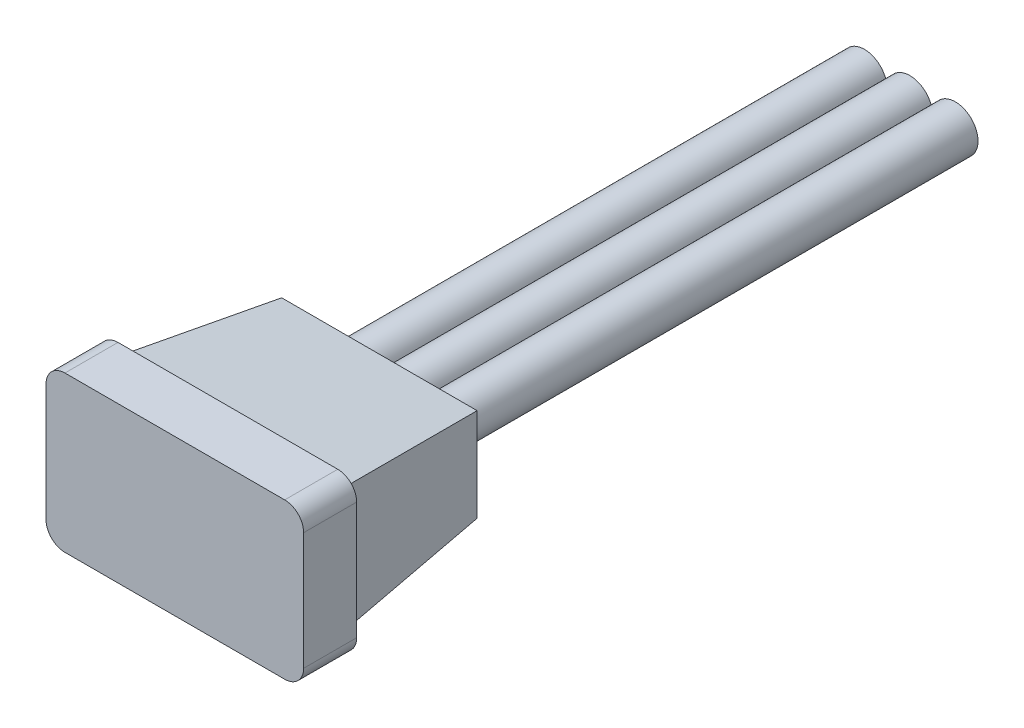
ISO-10303-21;
HEADER;
FILE_DESCRIPTION(('STEP AP214'),'2;1');
FILE_NAME('part.step','',(''),(''),'','','');
FILE_SCHEMA(('AUTOMOTIVE_DESIGN { 1 0 10303 214 1 1 1 1 }'));
ENDSEC;
DATA;
#1=APPLICATION_CONTEXT('core data for automotive mechanical design processes');
#2=APPLICATION_PROTOCOL_DEFINITION('international standard','automotive_design',2000,#1);
#3=PRODUCT_CONTEXT('',#1,'mechanical');
#4=PRODUCT('Part','Part','',(#3));
#5=PRODUCT_RELATED_PRODUCT_CATEGORY('part','',(#4));
#6=PRODUCT_DEFINITION_FORMATION('','',#4);
#7=PRODUCT_DEFINITION_CONTEXT('part definition',#1,'design');
#8=PRODUCT_DEFINITION('design','',#6,#7);
#9=PRODUCT_DEFINITION_SHAPE('','',#8);
#10=(LENGTH_UNIT() NAMED_UNIT(*) SI_UNIT(.MILLI.,.METRE.));
#11=(NAMED_UNIT(*) PLANE_ANGLE_UNIT() SI_UNIT($,.RADIAN.));
#12=(NAMED_UNIT(*) SI_UNIT($,.STERADIAN.) SOLID_ANGLE_UNIT());
#13=UNCERTAINTY_MEASURE_WITH_UNIT(LENGTH_MEASURE(1.E-05),#10,'distance_accuracy_value','');
#14=(GEOMETRIC_REPRESENTATION_CONTEXT(3) GLOBAL_UNCERTAINTY_ASSIGNED_CONTEXT((#13)) GLOBAL_UNIT_ASSIGNED_CONTEXT((#10,
#11,#12)) REPRESENTATION_CONTEXT('',''));
#15=CARTESIAN_POINT('',(0.,0.,0.));
#16=DIRECTION('',(0.,0.,1.));
#17=DIRECTION('',(1.,0.,0.));
#18=AXIS2_PLACEMENT_3D('',#15,#16,#17);
#19=CARTESIAN_POINT('',(1.2,0.,-21.0970562748477));
#20=DIRECTION('',(0.,0.,1.));
#21=DIRECTION('',(1.,0.,0.));
#22=AXIS2_PLACEMENT_3D('',#19,#20,#21);
#23=CYLINDRICAL_SURFACE('',#22,0.6);
#24=CARTESIAN_POINT('',(1.2,0.,-5.4));
#25=DIRECTION('',(0.,0.,-1.));
#26=DIRECTION('',(-1.,0.,0.));
#27=AXIS2_PLACEMENT_3D('',#24,#25,#26);
#28=CIRCLE('',#27,0.6);
#29=CARTESIAN_POINT('',(0.6,0.,-5.4));
#30=VERTEX_POINT('',#29);
#31=EDGE_CURVE('E54',#30,#30,#28,.T.);
#32=ORIENTED_EDGE('',*,*,#31,.T.);
#33=EDGE_LOOP('',(#32));
#34=FACE_BOUND('',#33,.T.);
#35=CARTESIAN_POINT('',(1.2,0.,-19.4));
#36=DIRECTION('',(0.,0.,-1.));
#37=DIRECTION('',(-1.,0.,0.));
#38=AXIS2_PLACEMENT_3D('',#35,#36,#37);
#39=CIRCLE('',#38,0.6);
#40=CARTESIAN_POINT('',(0.6,0.,-19.4));
#41=VERTEX_POINT('',#40);
#42=EDGE_CURVE('E11',#41,#41,#39,.T.);
#43=ORIENTED_EDGE('',*,*,#42,.F.);
#44=EDGE_LOOP('',(#43));
#45=FACE_BOUND('',#44,.T.);
#46=ADVANCED_FACE('F47',(#34,#45),#23,.T.);
#47=CARTESIAN_POINT('',(1.2,0.,-5.4));
#48=DIRECTION('',(0.,0.,-1.));
#49=DIRECTION('',(-1.,0.,0.));
#50=AXIS2_PLACEMENT_3D('',#47,#48,#49);
#51=PLANE('',#50);
#52=ORIENTED_EDGE('',*,*,#31,.F.);
#53=EDGE_LOOP('',(#52));
#54=FACE_BOUND('',#53,.T.);
#55=ADVANCED_FACE('F62',(#54),#51,.F.);
#56=CARTESIAN_POINT('',(0.,0.,-19.4));
#57=DIRECTION('',(0.,0.,-1.));
#58=DIRECTION('',(-1.,0.,0.));
#59=AXIS2_PLACEMENT_3D('',#56,#57,#58);
#60=PLANE('',#59);
#61=ORIENTED_EDGE('',*,*,#42,.T.);
#62=EDGE_LOOP('',(#61));
#63=FACE_BOUND('',#62,.T.);
#64=ADVANCED_FACE('F49',(#63),#60,.T.);
#65=CLOSED_SHELL('',(#46,#55,#64));
#66=MANIFOLD_SOLID_BREP('B2',#65);
#67=CARTESIAN_POINT('',(-1.2,0.,-21.0970562748477));
#68=DIRECTION('',(0.,0.,1.));
#69=DIRECTION('',(1.,0.,0.));
#70=AXIS2_PLACEMENT_3D('',#67,#68,#69);
#71=CYLINDRICAL_SURFACE('',#70,0.6);
#72=CARTESIAN_POINT('',(-1.2,0.,-5.4));
#73=DIRECTION('',(0.,0.,-1.));
#74=DIRECTION('',(-1.,0.,0.));
#75=AXIS2_PLACEMENT_3D('',#72,#73,#74);
#76=CIRCLE('',#75,0.6);
#77=CARTESIAN_POINT('',(-1.8,0.,-5.4));
#78=VERTEX_POINT('',#77);
#79=EDGE_CURVE('E107',#78,#78,#76,.T.);
#80=ORIENTED_EDGE('',*,*,#79,.T.);
#81=EDGE_LOOP('',(#80));
#82=FACE_BOUND('',#81,.T.);
#83=CARTESIAN_POINT('',(-1.2,0.,-19.4));
#84=DIRECTION('',(0.,0.,-1.));
#85=DIRECTION('',(-1.,0.,0.));
#86=AXIS2_PLACEMENT_3D('',#83,#84,#85);
#87=CIRCLE('',#86,0.6);
#88=CARTESIAN_POINT('',(-1.8,0.,-19.4));
#89=VERTEX_POINT('',#88);
#90=EDGE_CURVE('E46',#89,#89,#87,.T.);
#91=ORIENTED_EDGE('',*,*,#90,.F.);
#92=EDGE_LOOP('',(#91));
#93=FACE_BOUND('',#92,.T.);
#94=ADVANCED_FACE('F100',(#82,#93),#71,.T.);
#95=CARTESIAN_POINT('',(-1.2,0.,-5.4));
#96=DIRECTION('',(0.,0.,-1.));
#97=DIRECTION('',(-1.,0.,0.));
#98=AXIS2_PLACEMENT_3D('',#95,#96,#97);
#99=PLANE('',#98);
#100=ORIENTED_EDGE('',*,*,#79,.F.);
#101=EDGE_LOOP('',(#100));
#102=FACE_BOUND('',#101,.T.);
#103=ADVANCED_FACE('F116',(#102),#99,.F.);
#104=CARTESIAN_POINT('',(0.,0.,-19.4));
#105=DIRECTION('',(0.,0.,-1.));
#106=DIRECTION('',(-1.,0.,0.));
#107=AXIS2_PLACEMENT_3D('',#104,#105,#106);
#108=PLANE('',#107);
#109=ORIENTED_EDGE('',*,*,#90,.T.);
#110=EDGE_LOOP('',(#109));
#111=FACE_BOUND('',#110,.T.);
#112=ADVANCED_FACE('F102',(#111),#108,.T.);
#113=CLOSED_SHELL('',(#94,#103,#112));
#114=MANIFOLD_SOLID_BREP('B6',#113);
#115=CARTESIAN_POINT('',(0.,0.,-1.4));
#116=DIRECTION('',(0.,0.,1.));
#117=DIRECTION('',(1.,0.,0.));
#118=AXIS2_PLACEMENT_3D('',#115,#116,#117);
#119=PLANE('',#118);
#120=DIRECTION('',(1.,0.,0.));
#121=VECTOR('',#120,1.);
#122=CARTESIAN_POINT('',(-3.4,-2.05,-1.4));
#123=LINE('',#122,#121);
#124=CARTESIAN_POINT('',(-2.9,-2.05,-1.4));
#125=VERTEX_POINT('',#124);
#126=CARTESIAN_POINT('',(2.9,-2.05,-1.4));
#127=VERTEX_POINT('',#126);
#128=EDGE_CURVE('E291',#125,#127,#123,.T.);
#129=ORIENTED_EDGE('',*,*,#128,.F.);
#130=CARTESIAN_POINT('',(-2.9,-1.55,-1.4));
#131=DIRECTION('',(0.,0.,1.));
#132=DIRECTION('',(1.,0.,0.));
#133=AXIS2_PLACEMENT_3D('',#130,#131,#132);
#134=CIRCLE('',#133,0.5);
#135=CARTESIAN_POINT('',(-3.4,-1.55,-1.4));
#136=VERTEX_POINT('',#135);
#137=EDGE_CURVE('E331',#125,#136,#134,.F.);
#138=ORIENTED_EDGE('',*,*,#137,.T.);
#139=DIRECTION('',(0.,-1.,0.));
#140=VECTOR('',#139,1.);
#141=CARTESIAN_POINT('',(-3.4,2.05,-1.4));
#142=LINE('',#141,#140);
#143=CARTESIAN_POINT('',(-3.4,1.55,-1.4));
#144=VERTEX_POINT('',#143);
#145=EDGE_CURVE('E287',#144,#136,#142,.T.);
#146=ORIENTED_EDGE('',*,*,#145,.F.);
#147=CARTESIAN_POINT('',(-2.9,1.55,-1.4));
#148=DIRECTION('',(0.,0.,1.));
#149=DIRECTION('',(1.,0.,0.));
#150=AXIS2_PLACEMENT_3D('',#147,#148,#149);
#151=CIRCLE('',#150,0.5);
#152=CARTESIAN_POINT('',(-2.9,2.05,-1.4));
#153=VERTEX_POINT('',#152);
#154=EDGE_CURVE('E159',#144,#153,#151,.F.);
#155=ORIENTED_EDGE('',*,*,#154,.T.);
#156=DIRECTION('',(-1.,0.,0.));
#157=VECTOR('',#156,1.);
#158=CARTESIAN_POINT('',(-3.4,2.05,-1.4));
#159=LINE('',#158,#157);
#160=CARTESIAN_POINT('',(2.9,2.05,-1.4));
#161=VERTEX_POINT('',#160);
#162=EDGE_CURVE('E284',#161,#153,#159,.T.);
#163=ORIENTED_EDGE('',*,*,#162,.F.);
#164=CARTESIAN_POINT('',(2.9,1.55,-1.4));
#165=DIRECTION('',(0.,0.,1.));
#166=DIRECTION('',(1.,0.,0.));
#167=AXIS2_PLACEMENT_3D('',#164,#165,#166);
#168=CIRCLE('',#167,0.5);
#169=CARTESIAN_POINT('',(3.4,1.55,-1.4));
#170=VERTEX_POINT('',#169);
#171=EDGE_CURVE('E326',#161,#170,#168,.F.);
#172=ORIENTED_EDGE('',*,*,#171,.T.);
#173=DIRECTION('',(0.,1.,0.));
#174=VECTOR('',#173,1.);
#175=CARTESIAN_POINT('',(3.4,2.05,-1.4));
#176=LINE('',#175,#174);
#177=CARTESIAN_POINT('',(3.4,-1.55,-1.4));
#178=VERTEX_POINT('',#177);
#179=EDGE_CURVE('E281',#178,#170,#176,.T.);
#180=ORIENTED_EDGE('',*,*,#179,.F.);
#181=CARTESIAN_POINT('',(2.9,-1.55,-1.4));
#182=DIRECTION('',(0.,0.,1.));
#183=DIRECTION('',(1.,0.,0.));
#184=AXIS2_PLACEMENT_3D('',#181,#182,#183);
#185=CIRCLE('',#184,0.5);
#186=EDGE_CURVE('E328',#178,#127,#185,.F.);
#187=ORIENTED_EDGE('',*,*,#186,.T.);
#188=EDGE_LOOP('',(#129,#138,#146,#155,#163,#172,#180,#187));
#189=FACE_BOUND('',#188,.T.);
#190=DIRECTION('',(1.,0.,0.));
#191=VECTOR('',#190,1.);
#192=CARTESIAN_POINT('',(-3.,1.65,-1.4));
#193=LINE('',#192,#191);
#194=CARTESIAN_POINT('',(-3.,1.65,-1.4));
#195=VERTEX_POINT('',#194);
#196=CARTESIAN_POINT('',(3.,1.65,-1.4));
#197=VERTEX_POINT('',#196);
#198=EDGE_CURVE('E257',#195,#197,#193,.T.);
#199=ORIENTED_EDGE('',*,*,#198,.F.);
#200=DIRECTION('',(0.,1.,0.));
#201=VECTOR('',#200,1.);
#202=CARTESIAN_POINT('',(-3.,-1.65,-1.4));
#203=LINE('',#202,#201);
#204=CARTESIAN_POINT('',(-3.,-1.65,-1.4));
#205=VERTEX_POINT('',#204);
#206=EDGE_CURVE('E242',#205,#195,#203,.T.);
#207=ORIENTED_EDGE('',*,*,#206,.F.);
#208=DIRECTION('',(-1.,0.,0.));
#209=VECTOR('',#208,1.);
#210=CARTESIAN_POINT('',(3.,-1.65,-1.4));
#211=LINE('',#210,#209);
#212=CARTESIAN_POINT('',(3.,-1.65,-1.4));
#213=VERTEX_POINT('',#212);
#214=EDGE_CURVE('E237',#213,#205,#211,.T.);
#215=ORIENTED_EDGE('',*,*,#214,.F.);
#216=DIRECTION('',(0.,-1.,0.));
#217=VECTOR('',#216,1.);
#218=CARTESIAN_POINT('',(3.,1.65,-1.4));
#219=LINE('',#218,#217);
#220=EDGE_CURVE('E239',#197,#213,#219,.T.);
#221=ORIENTED_EDGE('',*,*,#220,.F.);
#222=EDGE_LOOP('',(#199,#207,#215,#221));
#223=FACE_BOUND('',#222,.T.);
#224=ADVANCED_FACE('F144',(#189,#223),#119,.F.);
#225=CARTESIAN_POINT('',(3.4,2.05,-1.4));
#226=DIRECTION('',(1.,0.,0.));
#227=DIRECTION('',(0.,1.,0.));
#228=AXIS2_PLACEMENT_3D('',#225,#226,#227);
#229=PLANE('',#228);
#230=DIRECTION('',(0.,1.,0.));
#231=VECTOR('',#230,1.);
#232=CARTESIAN_POINT('',(3.4,2.05,0.));
#233=LINE('',#232,#231);
#234=CARTESIAN_POINT('',(3.4,-1.55,0.));
#235=VERTEX_POINT('',#234);
#236=CARTESIAN_POINT('',(3.4,1.55,0.));
#237=VERTEX_POINT('',#236);
#238=EDGE_CURVE('E265',#235,#237,#233,.T.);
#239=ORIENTED_EDGE('',*,*,#238,.F.);
#240=DIRECTION('',(0.,0.,1.));
#241=VECTOR('',#240,1.);
#242=CARTESIAN_POINT('',(3.4,-1.55,-1.4));
#243=LINE('',#242,#241);
#244=EDGE_CURVE('E98',#235,#178,#243,.F.);
#245=ORIENTED_EDGE('',*,*,#244,.T.);
#246=ORIENTED_EDGE('',*,*,#179,.T.);
#247=DIRECTION('',(0.,0.,1.));
#248=VECTOR('',#247,1.);
#249=CARTESIAN_POINT('',(3.4,1.55,-1.4));
#250=LINE('',#249,#248);
#251=EDGE_CURVE('E152',#170,#237,#250,.T.);
#252=ORIENTED_EDGE('',*,*,#251,.T.);
#253=EDGE_LOOP('',(#239,#245,#246,#252));
#254=FACE_BOUND('',#253,.T.);
#255=ADVANCED_FACE('F341',(#254),#229,.T.);
#256=CARTESIAN_POINT('',(-3.4,-2.05,-1.4));
#257=DIRECTION('',(0.,-1.,0.));
#258=DIRECTION('',(0.,0.,-1.));
#259=AXIS2_PLACEMENT_3D('',#256,#257,#258);
#260=PLANE('',#259);
#261=DIRECTION('',(1.,0.,0.));
#262=VECTOR('',#261,1.);
#263=CARTESIAN_POINT('',(-3.4,-2.05,0.));
#264=LINE('',#263,#262);
#265=CARTESIAN_POINT('',(-2.9,-2.05,0.));
#266=VERTEX_POINT('',#265);
#267=CARTESIAN_POINT('',(2.9,-2.05,0.));
#268=VERTEX_POINT('',#267);
#269=EDGE_CURVE('E285',#266,#268,#264,.T.);
#270=ORIENTED_EDGE('',*,*,#269,.F.);
#271=DIRECTION('',(0.,0.,1.));
#272=VECTOR('',#271,1.);
#273=CARTESIAN_POINT('',(-2.9,-2.05,-1.4));
#274=LINE('',#273,#272);
#275=EDGE_CURVE('E324',#266,#125,#274,.F.);
#276=ORIENTED_EDGE('',*,*,#275,.T.);
#277=ORIENTED_EDGE('',*,*,#128,.T.);
#278=DIRECTION('',(0.,0.,1.));
#279=VECTOR('',#278,1.);
#280=CARTESIAN_POINT('',(2.9,-2.05,-1.4));
#281=LINE('',#280,#279);
#282=EDGE_CURVE('E321',#127,#268,#281,.T.);
#283=ORIENTED_EDGE('',*,*,#282,.T.);
#284=EDGE_LOOP('',(#270,#276,#277,#283));
#285=FACE_BOUND('',#284,.T.);
#286=ADVANCED_FACE('F354',(#285),#260,.T.);
#287=CARTESIAN_POINT('',(-3.4,2.05,-1.4));
#288=DIRECTION('',(-1.,0.,0.));
#289=DIRECTION('',(0.,-1.,0.));
#290=AXIS2_PLACEMENT_3D('',#287,#288,#289);
#291=PLANE('',#290);
#292=ORIENTED_EDGE('',*,*,#145,.T.);
#293=DIRECTION('',(0.,0.,1.));
#294=VECTOR('',#293,1.);
#295=CARTESIAN_POINT('',(-3.4,-1.55,-1.4));
#296=LINE('',#295,#294);
#297=CARTESIAN_POINT('',(-3.4,-1.55,0.));
#298=VERTEX_POINT('',#297);
#299=EDGE_CURVE('E309',#136,#298,#296,.T.);
#300=ORIENTED_EDGE('',*,*,#299,.T.);
#301=DIRECTION('',(0.,-1.,0.));
#302=VECTOR('',#301,1.);
#303=CARTESIAN_POINT('',(-3.4,2.05,0.));
#304=LINE('',#303,#302);
#305=CARTESIAN_POINT('',(-3.4,1.55,0.));
#306=VERTEX_POINT('',#305);
#307=EDGE_CURVE('E301',#306,#298,#304,.T.);
#308=ORIENTED_EDGE('',*,*,#307,.F.);
#309=DIRECTION('',(0.,0.,1.));
#310=VECTOR('',#309,1.);
#311=CARTESIAN_POINT('',(-3.4,1.55,-1.4));
#312=LINE('',#311,#310);
#313=EDGE_CURVE('E307',#306,#144,#312,.F.);
#314=ORIENTED_EDGE('',*,*,#313,.T.);
#315=EDGE_LOOP('',(#292,#300,#308,#314));
#316=FACE_BOUND('',#315,.T.);
#317=ADVANCED_FACE('F363',(#316),#291,.T.);
#318=CARTESIAN_POINT('',(-3.4,2.05,-1.4));
#319=DIRECTION('',(0.,1.,0.));
#320=DIRECTION('',(0.,0.,1.));
#321=AXIS2_PLACEMENT_3D('',#318,#319,#320);
#322=PLANE('',#321);
#323=ORIENTED_EDGE('',*,*,#162,.T.);
#324=DIRECTION('',(0.,0.,1.));
#325=VECTOR('',#324,1.);
#326=CARTESIAN_POINT('',(-2.9,2.05,-1.4));
#327=LINE('',#326,#325);
#328=CARTESIAN_POINT('',(-2.9,2.05,0.));
#329=VERTEX_POINT('',#328);
#330=EDGE_CURVE('E335',#153,#329,#327,.T.);
#331=ORIENTED_EDGE('',*,*,#330,.T.);
#332=DIRECTION('',(-1.,0.,0.));
#333=VECTOR('',#332,1.);
#334=CARTESIAN_POINT('',(-3.4,2.05,0.));
#335=LINE('',#334,#333);
#336=CARTESIAN_POINT('',(2.9,2.05,0.));
#337=VERTEX_POINT('',#336);
#338=EDGE_CURVE('E298',#337,#329,#335,.T.);
#339=ORIENTED_EDGE('',*,*,#338,.F.);
#340=DIRECTION('',(0.,0.,1.));
#341=VECTOR('',#340,1.);
#342=CARTESIAN_POINT('',(2.9,2.05,-1.4));
#343=LINE('',#342,#341);
#344=EDGE_CURVE('E166',#337,#161,#343,.F.);
#345=ORIENTED_EDGE('',*,*,#344,.T.);
#346=EDGE_LOOP('',(#323,#331,#339,#345));
#347=FACE_BOUND('',#346,.T.);
#348=ADVANCED_FACE('F368',(#347),#322,.T.);
#349=CARTESIAN_POINT('',(0.,0.,0.));
#350=DIRECTION('',(0.,0.,1.));
#351=DIRECTION('',(1.,0.,0.));
#352=AXIS2_PLACEMENT_3D('',#349,#350,#351);
#353=PLANE('',#352);
#354=ORIENTED_EDGE('',*,*,#307,.T.);
#355=CARTESIAN_POINT('',(-2.9,-1.55,0.));
#356=DIRECTION('',(0.,0.,1.));
#357=DIRECTION('',(1.,0.,0.));
#358=AXIS2_PLACEMENT_3D('',#355,#356,#357);
#359=CIRCLE('',#358,0.5);
#360=EDGE_CURVE('E319',#298,#266,#359,.T.);
#361=ORIENTED_EDGE('',*,*,#360,.T.);
#362=ORIENTED_EDGE('',*,*,#269,.T.);
#363=CARTESIAN_POINT('',(2.9,-1.55,0.));
#364=DIRECTION('',(0.,0.,1.));
#365=DIRECTION('',(1.,0.,0.));
#366=AXIS2_PLACEMENT_3D('',#363,#364,#365);
#367=CIRCLE('',#366,0.5);
#368=EDGE_CURVE('E315',#268,#235,#367,.T.);
#369=ORIENTED_EDGE('',*,*,#368,.T.);
#370=ORIENTED_EDGE('',*,*,#238,.T.);
#371=CARTESIAN_POINT('',(2.9,1.55,0.));
#372=DIRECTION('',(0.,0.,1.));
#373=DIRECTION('',(1.,0.,0.));
#374=AXIS2_PLACEMENT_3D('',#371,#372,#373);
#375=CIRCLE('',#374,0.5);
#376=EDGE_CURVE('E313',#237,#337,#375,.T.);
#377=ORIENTED_EDGE('',*,*,#376,.T.);
#378=ORIENTED_EDGE('',*,*,#338,.T.);
#379=CARTESIAN_POINT('',(-2.9,1.55,0.));
#380=DIRECTION('',(0.,0.,1.));
#381=DIRECTION('',(1.,0.,0.));
#382=AXIS2_PLACEMENT_3D('',#379,#380,#381);
#383=CIRCLE('',#382,0.5);
#384=EDGE_CURVE('E317',#329,#306,#383,.T.);
#385=ORIENTED_EDGE('',*,*,#384,.T.);
#386=EDGE_LOOP('',(#354,#361,#362,#369,#370,#377,#378,#385));
#387=FACE_BOUND('',#386,.T.);
#388=ADVANCED_FACE('F347',(#387),#353,.T.);
#389=CARTESIAN_POINT('',(-3.,1.65,-1.4));
#390=DIRECTION('',(0.,0.994521895368273,-0.104528463267654));
#391=DIRECTION('',(0.,0.104528463267654,0.994521895368273));
#392=AXIS2_PLACEMENT_3D('',#389,#390,#391);
#393=PLANE('',#392);
#394=ORIENTED_EDGE('',*,*,#198,.T.);
#395=DIRECTION('',(0.103962051184498,0.103962051184498,0.989132844377854));
#396=VECTOR('',#395,1.);
#397=CARTESIAN_POINT('',(3.,1.65,-1.4));
#398=LINE('',#397,#396);
#399=CARTESIAN_POINT('',(2.57958305893729,1.22958305893729,-5.4));
#400=VERTEX_POINT('',#399);
#401=EDGE_CURVE('E255',#400,#197,#398,.T.);
#402=ORIENTED_EDGE('',*,*,#401,.F.);
#403=DIRECTION('',(-1.,0.,0.));
#404=VECTOR('',#403,1.);
#405=CARTESIAN_POINT('',(-3.,1.22958305893729,-5.4));
#406=LINE('',#405,#404);
#407=CARTESIAN_POINT('',(-2.57958305893729,1.22958305893729,-5.4));
#408=VERTEX_POINT('',#407);
#409=EDGE_CURVE('E272',#408,#400,#406,.F.);
#410=ORIENTED_EDGE('',*,*,#409,.F.);
#411=DIRECTION('',(-0.103962051184498,0.103962051184498,0.989132844377854));
#412=VECTOR('',#411,1.);
#413=CARTESIAN_POINT('',(-3.,1.65,-1.4));
#414=LINE('',#413,#412);
#415=EDGE_CURVE('E268',#408,#195,#414,.T.);
#416=ORIENTED_EDGE('',*,*,#415,.T.);
#417=EDGE_LOOP('',(#394,#402,#410,#416));
#418=FACE_BOUND('',#417,.T.);
#419=ADVANCED_FACE('F384',(#418),#393,.T.);
#420=CARTESIAN_POINT('',(3.,1.65,-1.4));
#421=DIRECTION('',(0.994521895368273,0.,-0.104528463267654));
#422=DIRECTION('',(-0.104528463267654,0.,-0.994521895368273));
#423=AXIS2_PLACEMENT_3D('',#420,#421,#422);
#424=PLANE('',#423);
#425=ORIENTED_EDGE('',*,*,#220,.T.);
#426=DIRECTION('',(0.103962051184498,-0.103962051184498,0.989132844377854));
#427=VECTOR('',#426,1.);
#428=CARTESIAN_POINT('',(3.,-1.65,-1.4));
#429=LINE('',#428,#427);
#430=CARTESIAN_POINT('',(2.57958305893729,-1.22958305893729,-5.4));
#431=VERTEX_POINT('',#430);
#432=EDGE_CURVE('E252',#431,#213,#429,.T.);
#433=ORIENTED_EDGE('',*,*,#432,.F.);
#434=DIRECTION('',(0.,1.,0.));
#435=VECTOR('',#434,1.);
#436=CARTESIAN_POINT('',(2.57958305893729,1.65,-5.4));
#437=LINE('',#436,#435);
#438=EDGE_CURVE('E275',#400,#431,#437,.F.);
#439=ORIENTED_EDGE('',*,*,#438,.F.);
#440=ORIENTED_EDGE('',*,*,#401,.T.);
#441=EDGE_LOOP('',(#425,#433,#439,#440));
#442=FACE_BOUND('',#441,.T.);
#443=ADVANCED_FACE('F251',(#442),#424,.T.);
#444=CARTESIAN_POINT('',(3.,-1.65,-1.4));
#445=DIRECTION('',(0.,-0.994521895368273,-0.104528463267654));
#446=DIRECTION('',(0.,0.104528463267654,-0.994521895368273));
#447=AXIS2_PLACEMENT_3D('',#444,#445,#446);
#448=PLANE('',#447);
#449=ORIENTED_EDGE('',*,*,#214,.T.);
#450=DIRECTION('',(-0.103962051184498,-0.103962051184498,0.989132844377854));
#451=VECTOR('',#450,1.);
#452=CARTESIAN_POINT('',(-3.,-1.65,-1.4));
#453=LINE('',#452,#451);
#454=CARTESIAN_POINT('',(-2.57958305893729,-1.22958305893729,-5.4));
#455=VERTEX_POINT('',#454);
#456=EDGE_CURVE('E262',#455,#205,#453,.T.);
#457=ORIENTED_EDGE('',*,*,#456,.F.);
#458=DIRECTION('',(1.,0.,0.));
#459=VECTOR('',#458,1.);
#460=CARTESIAN_POINT('',(3.,-1.22958305893729,-5.4));
#461=LINE('',#460,#459);
#462=EDGE_CURVE('E260',#431,#455,#461,.F.);
#463=ORIENTED_EDGE('',*,*,#462,.F.);
#464=ORIENTED_EDGE('',*,*,#432,.T.);
#465=EDGE_LOOP('',(#449,#457,#463,#464));
#466=FACE_BOUND('',#465,.T.);
#467=ADVANCED_FACE('F259',(#466),#448,.T.);
#468=CARTESIAN_POINT('',(-3.,-1.65,-1.4));
#469=DIRECTION('',(-0.994521895368273,0.,-0.104528463267654));
#470=DIRECTION('',(-0.104528463267654,0.,0.994521895368273));
#471=AXIS2_PLACEMENT_3D('',#468,#469,#470);
#472=PLANE('',#471);
#473=ORIENTED_EDGE('',*,*,#206,.T.);
#474=ORIENTED_EDGE('',*,*,#415,.F.);
#475=DIRECTION('',(0.,-1.,0.));
#476=VECTOR('',#475,1.);
#477=CARTESIAN_POINT('',(-2.57958305893729,-1.65,-5.4));
#478=LINE('',#477,#476);
#479=EDGE_CURVE('E279',#455,#408,#478,.F.);
#480=ORIENTED_EDGE('',*,*,#479,.F.);
#481=ORIENTED_EDGE('',*,*,#456,.T.);
#482=EDGE_LOOP('',(#473,#474,#480,#481));
#483=FACE_BOUND('',#482,.T.);
#484=ADVANCED_FACE('F443',(#483),#472,.T.);
#485=CARTESIAN_POINT('',(0.,0.,-5.4));
#486=DIRECTION('',(0.,0.,-1.));
#487=DIRECTION('',(-1.,0.,0.));
#488=AXIS2_PLACEMENT_3D('',#485,#486,#487);
#489=PLANE('',#488);
#490=CARTESIAN_POINT('',(0.,0.,-5.4));
#491=DIRECTION('',(0.,0.,-1.));
#492=DIRECTION('',(-1.,0.,0.));
#493=AXIS2_PLACEMENT_3D('',#490,#491,#492);
#494=CIRCLE('',#493,0.6);
#495=CARTESIAN_POINT('',(-0.6,0.,-5.4));
#496=VERTEX_POINT('',#495);
#497=EDGE_CURVE('E295',#496,#496,#494,.T.);
#498=ORIENTED_EDGE('',*,*,#497,.F.);
#499=EDGE_LOOP('',(#498));
#500=FACE_BOUND('',#499,.T.);
#501=ORIENTED_EDGE('',*,*,#409,.T.);
#502=ORIENTED_EDGE('',*,*,#438,.T.);
#503=ORIENTED_EDGE('',*,*,#462,.T.);
#504=ORIENTED_EDGE('',*,*,#479,.T.);
#505=EDGE_LOOP('',(#501,#502,#503,#504));
#506=FACE_BOUND('',#505,.T.);
#507=ADVANCED_FACE('F433',(#500,#506),#489,.T.);
#508=CARTESIAN_POINT('',(0.,0.,-19.4));
#509=DIRECTION('',(0.,0.,1.));
#510=DIRECTION('',(1.,0.,0.));
#511=AXIS2_PLACEMENT_3D('',#508,#509,#510);
#512=CYLINDRICAL_SURFACE('',#511,0.6);
#513=CARTESIAN_POINT('',(0.,0.,-19.4));
#514=DIRECTION('',(0.,0.,-1.));
#515=DIRECTION('',(-1.,0.,0.));
#516=AXIS2_PLACEMENT_3D('',#513,#514,#515);
#517=CIRCLE('',#516,0.6);
#518=CARTESIAN_POINT('',(-0.6,0.,-19.4));
#519=VERTEX_POINT('',#518);
#520=EDGE_CURVE('E520',#519,#519,#517,.T.);
#521=ORIENTED_EDGE('',*,*,#520,.F.);
#522=EDGE_LOOP('',(#521));
#523=FACE_BOUND('',#522,.T.);
#524=ORIENTED_EDGE('',*,*,#497,.T.);
#525=EDGE_LOOP('',(#524));
#526=FACE_BOUND('',#525,.T.);
#527=ADVANCED_FACE('F424',(#523,#526),#512,.T.);
#528=CARTESIAN_POINT('',(0.,0.,-19.4));
#529=DIRECTION('',(0.,0.,-1.));
#530=DIRECTION('',(-1.,0.,0.));
#531=AXIS2_PLACEMENT_3D('',#528,#529,#530);
#532=PLANE('',#531);
#533=ORIENTED_EDGE('',*,*,#520,.T.);
#534=EDGE_LOOP('',(#533));
#535=FACE_BOUND('',#534,.T.);
#536=ADVANCED_FACE('F393',(#535),#532,.T.);
#537=CARTESIAN_POINT('',(-2.9,-1.55,-1.4));
#538=DIRECTION('',(0.,0.,1.));
#539=DIRECTION('',(1.,0.,0.));
#540=AXIS2_PLACEMENT_3D('',#537,#538,#539);
#541=CYLINDRICAL_SURFACE('',#540,0.5);
#542=ORIENTED_EDGE('',*,*,#137,.F.);
#543=ORIENTED_EDGE('',*,*,#275,.F.);
#544=ORIENTED_EDGE('',*,*,#360,.F.);
#545=ORIENTED_EDGE('',*,*,#299,.F.);
#546=EDGE_LOOP('',(#542,#543,#544,#545));
#547=FACE_BOUND('',#546,.T.);
#548=ADVANCED_FACE('F360',(#547),#541,.T.);
#549=CARTESIAN_POINT('',(-2.9,1.55,-1.4));
#550=DIRECTION('',(0.,0.,1.));
#551=DIRECTION('',(1.,0.,0.));
#552=AXIS2_PLACEMENT_3D('',#549,#550,#551);
#553=CYLINDRICAL_SURFACE('',#552,0.5);
#554=ORIENTED_EDGE('',*,*,#154,.F.);
#555=ORIENTED_EDGE('',*,*,#313,.F.);
#556=ORIENTED_EDGE('',*,*,#384,.F.);
#557=ORIENTED_EDGE('',*,*,#330,.F.);
#558=EDGE_LOOP('',(#554,#555,#556,#557));
#559=FACE_BOUND('',#558,.T.);
#560=ADVANCED_FACE('F367',(#559),#553,.T.);
#561=CARTESIAN_POINT('',(2.9,-1.55,-1.4));
#562=DIRECTION('',(0.,0.,1.));
#563=DIRECTION('',(1.,0.,0.));
#564=AXIS2_PLACEMENT_3D('',#561,#562,#563);
#565=CYLINDRICAL_SURFACE('',#564,0.5);
#566=ORIENTED_EDGE('',*,*,#186,.F.);
#567=ORIENTED_EDGE('',*,*,#244,.F.);
#568=ORIENTED_EDGE('',*,*,#368,.F.);
#569=ORIENTED_EDGE('',*,*,#282,.F.);
#570=EDGE_LOOP('',(#566,#567,#568,#569));
#571=FACE_BOUND('',#570,.T.);
#572=ADVANCED_FACE('F352',(#571),#565,.T.);
#573=CARTESIAN_POINT('',(2.9,1.55,-1.4));
#574=DIRECTION('',(0.,0.,1.));
#575=DIRECTION('',(1.,0.,0.));
#576=AXIS2_PLACEMENT_3D('',#573,#574,#575);
#577=CYLINDRICAL_SURFACE('',#576,0.5);
#578=ORIENTED_EDGE('',*,*,#171,.F.);
#579=ORIENTED_EDGE('',*,*,#344,.F.);
#580=ORIENTED_EDGE('',*,*,#376,.F.);
#581=ORIENTED_EDGE('',*,*,#251,.F.);
#582=EDGE_LOOP('',(#578,#579,#580,#581));
#583=FACE_BOUND('',#582,.T.);
#584=ADVANCED_FACE('F146',(#583),#577,.T.);
#585=CLOSED_SHELL('',(#224,#255,#286,#317,#348,#388,#419,#443,#467,#484,#507,#527,#536,#548,
#560,#572,#584));
#586=MANIFOLD_SOLID_BREP('B41',#585);
#587=ADVANCED_BREP_SHAPE_REPRESENTATION('',(#18,#66,#114,#586),#14);
#588=SHAPE_DEFINITION_REPRESENTATION(#9,#587);
ENDSEC;
END-ISO-10303-21;
